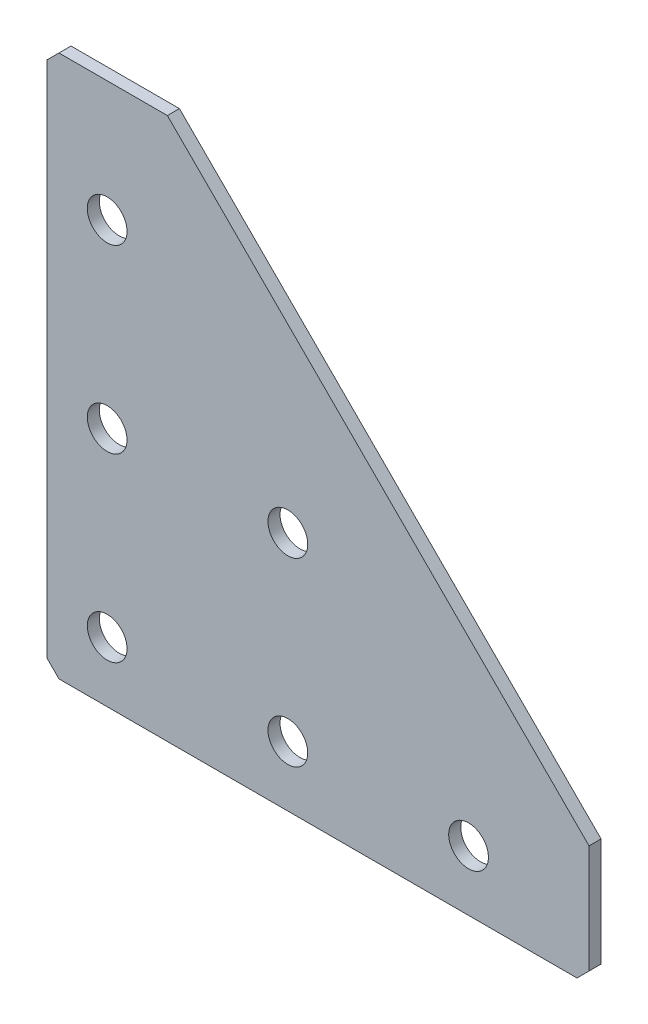
ISO-10303-21;
HEADER;
FILE_DESCRIPTION(('STEP AP214'),'2;1');
FILE_NAME('part.step','',(''),(''),'','','');
FILE_SCHEMA(('AUTOMOTIVE_DESIGN { 1 0 10303 214 1 1 1 1 }'));
ENDSEC;
DATA;
#1=APPLICATION_CONTEXT('core data for automotive mechanical design processes');
#2=APPLICATION_PROTOCOL_DEFINITION('international standard','automotive_design',2000,#1);
#3=PRODUCT_CONTEXT('',#1,'mechanical');
#4=PRODUCT('Part','Part','',(#3));
#5=PRODUCT_RELATED_PRODUCT_CATEGORY('part','',(#4));
#6=PRODUCT_DEFINITION_FORMATION('','',#4);
#7=PRODUCT_DEFINITION_CONTEXT('part definition',#1,'design');
#8=PRODUCT_DEFINITION('design','',#6,#7);
#9=PRODUCT_DEFINITION_SHAPE('','',#8);
#10=(LENGTH_UNIT() NAMED_UNIT(*) SI_UNIT(.MILLI.,.METRE.));
#11=(NAMED_UNIT(*) PLANE_ANGLE_UNIT() SI_UNIT($,.RADIAN.));
#12=(NAMED_UNIT(*) SI_UNIT($,.STERADIAN.) SOLID_ANGLE_UNIT());
#13=UNCERTAINTY_MEASURE_WITH_UNIT(LENGTH_MEASURE(1.E-05),#10,'distance_accuracy_value','');
#14=(GEOMETRIC_REPRESENTATION_CONTEXT(3) GLOBAL_UNCERTAINTY_ASSIGNED_CONTEXT((#13)) GLOBAL_UNIT_ASSIGNED_CONTEXT((#10,
#11,#12)) REPRESENTATION_CONTEXT('',''));
#15=CARTESIAN_POINT('',(0.,0.,0.));
#16=DIRECTION('',(0.,0.,1.));
#17=DIRECTION('',(1.,0.,0.));
#18=AXIS2_PLACEMENT_3D('',#15,#16,#17);
#19=CARTESIAN_POINT('',(20.,0.,-2.));
#20=DIRECTION('',(0.,-1.,0.));
#21=DIRECTION('',(1.,0.,0.));
#22=AXIS2_PLACEMENT_3D('',#19,#20,#21);
#23=PLANE('',#22);
#24=DIRECTION('',(1.,0.,0.));
#25=VECTOR('',#24,1.);
#26=CARTESIAN_POINT('',(20.,0.,-2.));
#27=LINE('',#26,#25);
#28=CARTESIAN_POINT('',(2.00000000000002,0.,-2.));
#29=VERTEX_POINT('',#28);
#30=CARTESIAN_POINT('',(20.,0.,-2.));
#31=VERTEX_POINT('',#30);
#32=EDGE_CURVE('E110',#29,#31,#27,.T.);
#33=ORIENTED_EDGE('',*,*,#32,.F.);
#34=DIRECTION('',(0.,0.,1.));
#35=VECTOR('',#34,1.);
#36=CARTESIAN_POINT('',(2.00000000000002,0.,-2.));
#37=LINE('',#36,#35);
#38=CARTESIAN_POINT('',(2.00000000000002,0.,0.));
#39=VERTEX_POINT('',#38);
#40=EDGE_CURVE('E139',#29,#39,#37,.T.);
#41=ORIENTED_EDGE('',*,*,#40,.T.);
#42=DIRECTION('',(1.,0.,0.));
#43=VECTOR('',#42,1.);
#44=CARTESIAN_POINT('',(20.,0.,0.));
#45=LINE('',#44,#43);
#46=CARTESIAN_POINT('',(20.,0.,0.));
#47=VERTEX_POINT('',#46);
#48=EDGE_CURVE('E136',#39,#47,#45,.T.);
#49=ORIENTED_EDGE('',*,*,#48,.T.);
#50=DIRECTION('',(0.,0.,1.));
#51=VECTOR('',#50,1.);
#52=CARTESIAN_POINT('',(20.,0.,-2.));
#53=LINE('',#52,#51);
#54=EDGE_CURVE('E128',#31,#47,#53,.T.);
#55=ORIENTED_EDGE('',*,*,#54,.F.);
#56=EDGE_LOOP('',(#33,#41,#49,#55));
#57=FACE_BOUND('',#56,.T.);
#58=ADVANCED_FACE('F45',(#57),#23,.F.);
#59=CARTESIAN_POINT('',(20.,0.,-2.));
#60=DIRECTION('',(-0.707106781186548,-0.707106781186547,0.));
#61=DIRECTION('',(0.707106781186547,-0.707106781186548,0.));
#62=AXIS2_PLACEMENT_3D('',#59,#60,#61);
#63=PLANE('',#62);
#64=DIRECTION('',(0.707106781186547,-0.707106781186548,0.));
#65=VECTOR('',#64,1.);
#66=CARTESIAN_POINT('',(20.,0.,0.));
#67=LINE('',#66,#65);
#68=CARTESIAN_POINT('',(90.,-70.,0.));
#69=VERTEX_POINT('',#68);
#70=EDGE_CURVE('E197',#47,#69,#67,.T.);
#71=ORIENTED_EDGE('',*,*,#70,.T.);
#72=DIRECTION('',(0.,0.,1.));
#73=VECTOR('',#72,1.);
#74=CARTESIAN_POINT('',(90.,-70.,-2.));
#75=LINE('',#74,#73);
#76=CARTESIAN_POINT('',(90.,-70.,-2.));
#77=VERTEX_POINT('',#76);
#78=EDGE_CURVE('E130',#77,#69,#75,.T.);
#79=ORIENTED_EDGE('',*,*,#78,.F.);
#80=DIRECTION('',(0.707106781186547,-0.707106781186548,0.));
#81=VECTOR('',#80,1.);
#82=CARTESIAN_POINT('',(20.,0.,-2.));
#83=LINE('',#82,#81);
#84=EDGE_CURVE('E114',#31,#77,#83,.T.);
#85=ORIENTED_EDGE('',*,*,#84,.F.);
#86=ORIENTED_EDGE('',*,*,#54,.T.);
#87=EDGE_LOOP('',(#71,#79,#85,#86));
#88=FACE_BOUND('',#87,.T.);
#89=ADVANCED_FACE('F127',(#88),#63,.F.);
#90=CARTESIAN_POINT('',(90.,-90.,-2.));
#91=DIRECTION('',(-1.,0.,0.));
#92=DIRECTION('',(0.,-1.,0.));
#93=AXIS2_PLACEMENT_3D('',#90,#91,#92);
#94=PLANE('',#93);
#95=DIRECTION('',(0.,-1.,0.));
#96=VECTOR('',#95,1.);
#97=CARTESIAN_POINT('',(90.,-90.,0.));
#98=LINE('',#97,#96);
#99=CARTESIAN_POINT('',(90.,-88.,0.));
#100=VERTEX_POINT('',#99);
#101=EDGE_CURVE('E190',#69,#100,#98,.T.);
#102=ORIENTED_EDGE('',*,*,#101,.T.);
#103=DIRECTION('',(0.,0.,-1.));
#104=VECTOR('',#103,1.);
#105=CARTESIAN_POINT('',(90.,-88.,-2.));
#106=LINE('',#105,#104);
#107=CARTESIAN_POINT('',(90.,-88.,-2.));
#108=VERTEX_POINT('',#107);
#109=EDGE_CURVE('E11',#100,#108,#106,.T.);
#110=ORIENTED_EDGE('',*,*,#109,.T.);
#111=DIRECTION('',(0.,-1.,0.));
#112=VECTOR('',#111,1.);
#113=CARTESIAN_POINT('',(90.,-90.,-2.));
#114=LINE('',#113,#112);
#115=EDGE_CURVE('E133',#77,#108,#114,.T.);
#116=ORIENTED_EDGE('',*,*,#115,.F.);
#117=ORIENTED_EDGE('',*,*,#78,.T.);
#118=EDGE_LOOP('',(#102,#110,#116,#117));
#119=FACE_BOUND('',#118,.T.);
#120=ADVANCED_FACE('F297',(#119),#94,.F.);
#121=CARTESIAN_POINT('',(0.,-90.,-2.));
#122=DIRECTION('',(0.,1.,0.));
#123=DIRECTION('',(0.,0.,1.));
#124=AXIS2_PLACEMENT_3D('',#121,#122,#123);
#125=PLANE('',#124);
#126=DIRECTION('',(-1.,0.,0.));
#127=VECTOR('',#126,1.);
#128=CARTESIAN_POINT('',(0.,-90.,-2.));
#129=LINE('',#128,#127);
#130=CARTESIAN_POINT('',(88.,-90.,-2.));
#131=VERTEX_POINT('',#130);
#132=CARTESIAN_POINT('',(2.,-90.,-2.));
#133=VERTEX_POINT('',#132);
#134=EDGE_CURVE('E182',#131,#133,#129,.T.);
#135=ORIENTED_EDGE('',*,*,#134,.F.);
#136=DIRECTION('',(0.,0.,1.));
#137=VECTOR('',#136,1.);
#138=CARTESIAN_POINT('',(88.,-90.,-2.));
#139=LINE('',#138,#137);
#140=CARTESIAN_POINT('',(88.,-90.,0.));
#141=VERTEX_POINT('',#140);
#142=EDGE_CURVE('E54',#131,#141,#139,.T.);
#143=ORIENTED_EDGE('',*,*,#142,.T.);
#144=DIRECTION('',(-1.,0.,0.));
#145=VECTOR('',#144,1.);
#146=CARTESIAN_POINT('',(0.,-90.,0.));
#147=LINE('',#146,#145);
#148=CARTESIAN_POINT('',(2.,-90.,0.));
#149=VERTEX_POINT('',#148);
#150=EDGE_CURVE('E181',#141,#149,#147,.T.);
#151=ORIENTED_EDGE('',*,*,#150,.T.);
#152=DIRECTION('',(0.,0.,-1.));
#153=VECTOR('',#152,1.);
#154=CARTESIAN_POINT('',(2.,-90.,-2.));
#155=LINE('',#154,#153);
#156=EDGE_CURVE('E61',#149,#133,#155,.T.);
#157=ORIENTED_EDGE('',*,*,#156,.T.);
#158=EDGE_LOOP('',(#135,#143,#151,#157));
#159=FACE_BOUND('',#158,.T.);
#160=ADVANCED_FACE('F180',(#159),#125,.F.);
#161=CARTESIAN_POINT('',(0.,0.,-2.));
#162=DIRECTION('',(1.,0.,0.));
#163=DIRECTION('',(0.,0.,-1.));
#164=AXIS2_PLACEMENT_3D('',#161,#162,#163);
#165=PLANE('',#164);
#166=DIRECTION('',(0.,1.,0.));
#167=VECTOR('',#166,1.);
#168=CARTESIAN_POINT('',(0.,0.,0.));
#169=LINE('',#168,#167);
#170=CARTESIAN_POINT('',(0.,-88.,0.));
#171=VERTEX_POINT('',#170);
#172=CARTESIAN_POINT('',(0.,-2.00000000000002,0.));
#173=VERTEX_POINT('',#172);
#174=EDGE_CURVE('E123',#171,#173,#169,.T.);
#175=ORIENTED_EDGE('',*,*,#174,.T.);
#176=DIRECTION('',(0.,0.,-1.));
#177=VECTOR('',#176,1.);
#178=CARTESIAN_POINT('',(0.,-2.00000000000002,-2.));
#179=LINE('',#178,#177);
#180=CARTESIAN_POINT('',(0.,-2.00000000000002,-2.));
#181=VERTEX_POINT('',#180);
#182=EDGE_CURVE('E163',#173,#181,#179,.T.);
#183=ORIENTED_EDGE('',*,*,#182,.T.);
#184=DIRECTION('',(0.,1.,0.));
#185=VECTOR('',#184,1.);
#186=CARTESIAN_POINT('',(0.,0.,-2.));
#187=LINE('',#186,#185);
#188=CARTESIAN_POINT('',(0.,-88.,-2.));
#189=VERTEX_POINT('',#188);
#190=EDGE_CURVE('E147',#189,#181,#187,.T.);
#191=ORIENTED_EDGE('',*,*,#190,.F.);
#192=DIRECTION('',(0.,0.,1.));
#193=VECTOR('',#192,1.);
#194=CARTESIAN_POINT('',(0.,-88.,-2.));
#195=LINE('',#194,#193);
#196=EDGE_CURVE('E159',#189,#171,#195,.T.);
#197=ORIENTED_EDGE('',*,*,#196,.T.);
#198=EDGE_LOOP('',(#175,#183,#191,#197));
#199=FACE_BOUND('',#198,.T.);
#200=ADVANCED_FACE('F265',(#199),#165,.F.);
#201=CARTESIAN_POINT('',(0.,0.,-2.));
#202=DIRECTION('',(0.,0.,1.));
#203=DIRECTION('',(1.,0.,0.));
#204=AXIS2_PLACEMENT_3D('',#201,#202,#203);
#205=PLANE('',#204);
#206=CARTESIAN_POINT('',(40.,-80.,-2.));
#207=DIRECTION('',(0.,0.,-1.));
#208=DIRECTION('',(0.,1.,0.));
#209=AXIS2_PLACEMENT_3D('',#206,#207,#208);
#210=CIRCLE('',#209,3.3);
#211=CARTESIAN_POINT('',(40.,-76.7,-2.));
#212=VERTEX_POINT('',#211);
#213=EDGE_CURVE('E254',#212,#212,#210,.T.);
#214=ORIENTED_EDGE('',*,*,#213,.F.);
#215=EDGE_LOOP('',(#214));
#216=FACE_BOUND('',#215,.T.);
#217=CARTESIAN_POINT('',(10.,-80.,-2.));
#218=DIRECTION('',(0.,0.,-1.));
#219=DIRECTION('',(0.,1.,0.));
#220=AXIS2_PLACEMENT_3D('',#217,#218,#219);
#221=CIRCLE('',#220,3.3);
#222=CARTESIAN_POINT('',(10.,-76.7,-2.));
#223=VERTEX_POINT('',#222);
#224=EDGE_CURVE('E246',#223,#223,#221,.T.);
#225=ORIENTED_EDGE('',*,*,#224,.F.);
#226=EDGE_LOOP('',(#225));
#227=FACE_BOUND('',#226,.T.);
#228=CARTESIAN_POINT('',(10.,-50.,-2.));
#229=DIRECTION('',(0.,0.,-1.));
#230=DIRECTION('',(0.,1.,0.));
#231=AXIS2_PLACEMENT_3D('',#228,#229,#230);
#232=CIRCLE('',#231,3.3);
#233=CARTESIAN_POINT('',(10.,-46.7,-2.));
#234=VERTEX_POINT('',#233);
#235=EDGE_CURVE('E238',#234,#234,#232,.T.);
#236=ORIENTED_EDGE('',*,*,#235,.F.);
#237=EDGE_LOOP('',(#236));
#238=FACE_BOUND('',#237,.T.);
#239=CARTESIAN_POINT('',(10.,-20.,-2.));
#240=DIRECTION('',(0.,0.,-1.));
#241=DIRECTION('',(0.,1.,0.));
#242=AXIS2_PLACEMENT_3D('',#239,#240,#241);
#243=CIRCLE('',#242,3.3);
#244=CARTESIAN_POINT('',(10.,-16.7,-2.));
#245=VERTEX_POINT('',#244);
#246=EDGE_CURVE('E230',#245,#245,#243,.T.);
#247=ORIENTED_EDGE('',*,*,#246,.F.);
#248=EDGE_LOOP('',(#247));
#249=FACE_BOUND('',#248,.T.);
#250=CARTESIAN_POINT('',(70.,-80.,-2.));
#251=DIRECTION('',(0.,0.,-1.));
#252=DIRECTION('',(0.,1.,0.));
#253=AXIS2_PLACEMENT_3D('',#250,#251,#252);
#254=CIRCLE('',#253,3.3);
#255=CARTESIAN_POINT('',(70.,-76.7,-2.));
#256=VERTEX_POINT('',#255);
#257=EDGE_CURVE('E222',#256,#256,#254,.T.);
#258=ORIENTED_EDGE('',*,*,#257,.F.);
#259=EDGE_LOOP('',(#258));
#260=FACE_BOUND('',#259,.T.);
#261=CARTESIAN_POINT('',(40.,-50.,-2.));
#262=DIRECTION('',(0.,0.,-1.));
#263=DIRECTION('',(0.,1.,0.));
#264=AXIS2_PLACEMENT_3D('',#261,#262,#263);
#265=CIRCLE('',#264,3.3);
#266=CARTESIAN_POINT('',(40.,-46.7,-2.));
#267=VERTEX_POINT('',#266);
#268=EDGE_CURVE('E214',#267,#267,#265,.T.);
#269=ORIENTED_EDGE('',*,*,#268,.F.);
#270=EDGE_LOOP('',(#269));
#271=FACE_BOUND('',#270,.T.);
#272=ORIENTED_EDGE('',*,*,#190,.T.);
#273=DIRECTION('',(-0.707106781186547,-0.707106781186548,0.));
#274=VECTOR('',#273,1.);
#275=CARTESIAN_POINT('',(2.00000000000002,0.,-2.));
#276=LINE('',#275,#274);
#277=EDGE_CURVE('E117',#181,#29,#276,.F.);
#278=ORIENTED_EDGE('',*,*,#277,.T.);
#279=ORIENTED_EDGE('',*,*,#32,.T.);
#280=ORIENTED_EDGE('',*,*,#84,.T.);
#281=ORIENTED_EDGE('',*,*,#115,.T.);
#282=DIRECTION('',(0.707106781186548,0.707106781186548,0.));
#283=VECTOR('',#282,1.);
#284=CARTESIAN_POINT('',(88.,-90.,-2.));
#285=LINE('',#284,#283);
#286=EDGE_CURVE('E68',#108,#131,#285,.F.);
#287=ORIENTED_EDGE('',*,*,#286,.T.);
#288=ORIENTED_EDGE('',*,*,#134,.T.);
#289=DIRECTION('',(0.70710678118655,-0.707106781186545,0.));
#290=VECTOR('',#289,1.);
#291=CARTESIAN_POINT('',(0.,-88.,-2.));
#292=LINE('',#291,#290);
#293=EDGE_CURVE('E166',#133,#189,#292,.F.);
#294=ORIENTED_EDGE('',*,*,#293,.T.);
#295=EDGE_LOOP('',(#272,#278,#279,#280,#281,#287,#288,#294));
#296=FACE_BOUND('',#295,.T.);
#297=ADVANCED_FACE('F113',(#216,#227,#238,#249,#260,#271,#296),#205,.F.);
#298=CARTESIAN_POINT('',(0.,0.,0.));
#299=DIRECTION('',(0.,0.,1.));
#300=DIRECTION('',(1.,0.,0.));
#301=AXIS2_PLACEMENT_3D('',#298,#299,#300);
#302=PLANE('',#301);
#303=CARTESIAN_POINT('',(40.,-80.,0.));
#304=DIRECTION('',(0.,0.,-1.));
#305=DIRECTION('',(0.,1.,0.));
#306=AXIS2_PLACEMENT_3D('',#303,#304,#305);
#307=CIRCLE('',#306,3.3);
#308=CARTESIAN_POINT('',(40.,-76.7,0.));
#309=VERTEX_POINT('',#308);
#310=EDGE_CURVE('E250',#309,#309,#307,.T.);
#311=ORIENTED_EDGE('',*,*,#310,.T.);
#312=EDGE_LOOP('',(#311));
#313=FACE_BOUND('',#312,.T.);
#314=CARTESIAN_POINT('',(10.,-80.,0.));
#315=DIRECTION('',(0.,0.,-1.));
#316=DIRECTION('',(0.,1.,0.));
#317=AXIS2_PLACEMENT_3D('',#314,#315,#316);
#318=CIRCLE('',#317,3.3);
#319=CARTESIAN_POINT('',(10.,-76.7,0.));
#320=VERTEX_POINT('',#319);
#321=EDGE_CURVE('E242',#320,#320,#318,.T.);
#322=ORIENTED_EDGE('',*,*,#321,.T.);
#323=EDGE_LOOP('',(#322));
#324=FACE_BOUND('',#323,.T.);
#325=CARTESIAN_POINT('',(10.,-50.,0.));
#326=DIRECTION('',(0.,0.,-1.));
#327=DIRECTION('',(0.,1.,0.));
#328=AXIS2_PLACEMENT_3D('',#325,#326,#327);
#329=CIRCLE('',#328,3.3);
#330=CARTESIAN_POINT('',(10.,-46.7,0.));
#331=VERTEX_POINT('',#330);
#332=EDGE_CURVE('E234',#331,#331,#329,.T.);
#333=ORIENTED_EDGE('',*,*,#332,.T.);
#334=EDGE_LOOP('',(#333));
#335=FACE_BOUND('',#334,.T.);
#336=CARTESIAN_POINT('',(10.,-20.,0.));
#337=DIRECTION('',(0.,0.,-1.));
#338=DIRECTION('',(0.,1.,0.));
#339=AXIS2_PLACEMENT_3D('',#336,#337,#338);
#340=CIRCLE('',#339,3.3);
#341=CARTESIAN_POINT('',(10.,-16.7,0.));
#342=VERTEX_POINT('',#341);
#343=EDGE_CURVE('E226',#342,#342,#340,.T.);
#344=ORIENTED_EDGE('',*,*,#343,.T.);
#345=EDGE_LOOP('',(#344));
#346=FACE_BOUND('',#345,.T.);
#347=CARTESIAN_POINT('',(70.,-80.,0.));
#348=DIRECTION('',(0.,0.,-1.));
#349=DIRECTION('',(0.,1.,0.));
#350=AXIS2_PLACEMENT_3D('',#347,#348,#349);
#351=CIRCLE('',#350,3.3);
#352=CARTESIAN_POINT('',(70.,-76.7,0.));
#353=VERTEX_POINT('',#352);
#354=EDGE_CURVE('E218',#353,#353,#351,.T.);
#355=ORIENTED_EDGE('',*,*,#354,.T.);
#356=EDGE_LOOP('',(#355));
#357=FACE_BOUND('',#356,.T.);
#358=CARTESIAN_POINT('',(40.,-50.,0.));
#359=DIRECTION('',(0.,0.,-1.));
#360=DIRECTION('',(0.,1.,0.));
#361=AXIS2_PLACEMENT_3D('',#358,#359,#360);
#362=CIRCLE('',#361,3.3);
#363=CARTESIAN_POINT('',(40.,-46.7,0.));
#364=VERTEX_POINT('',#363);
#365=EDGE_CURVE('E204',#364,#364,#362,.T.);
#366=ORIENTED_EDGE('',*,*,#365,.T.);
#367=EDGE_LOOP('',(#366));
#368=FACE_BOUND('',#367,.T.);
#369=ORIENTED_EDGE('',*,*,#48,.F.);
#370=DIRECTION('',(0.707106781186547,0.707106781186548,0.));
#371=VECTOR('',#370,1.);
#372=CARTESIAN_POINT('',(1.00000000000001,-1.00000000000001,0.));
#373=LINE('',#372,#371);
#374=EDGE_CURVE('E156',#39,#173,#373,.F.);
#375=ORIENTED_EDGE('',*,*,#374,.T.);
#376=ORIENTED_EDGE('',*,*,#174,.F.);
#377=DIRECTION('',(-0.70710678118655,0.707106781186545,0.));
#378=VECTOR('',#377,1.);
#379=CARTESIAN_POINT('',(-44.,-44.0000000000003,0.));
#380=LINE('',#379,#378);
#381=EDGE_CURVE('E145',#171,#149,#380,.F.);
#382=ORIENTED_EDGE('',*,*,#381,.T.);
#383=ORIENTED_EDGE('',*,*,#150,.F.);
#384=DIRECTION('',(-0.707106781186548,-0.707106781186548,0.));
#385=VECTOR('',#384,1.);
#386=CARTESIAN_POINT('',(89.,-89.,0.));
#387=LINE('',#386,#385);
#388=EDGE_CURVE('E153',#141,#100,#387,.F.);
#389=ORIENTED_EDGE('',*,*,#388,.T.);
#390=ORIENTED_EDGE('',*,*,#101,.F.);
#391=ORIENTED_EDGE('',*,*,#70,.F.);
#392=EDGE_LOOP('',(#369,#375,#376,#382,#383,#389,#390,#391));
#393=FACE_BOUND('',#392,.T.);
#394=ADVANCED_FACE('F185',(#313,#324,#335,#346,#357,#368,#393),#302,.T.);
#395=CARTESIAN_POINT('',(40.,-50.,-2.));
#396=DIRECTION('',(0.,0.,-1.));
#397=DIRECTION('',(0.,1.,0.));
#398=AXIS2_PLACEMENT_3D('',#395,#396,#397);
#399=CYLINDRICAL_SURFACE('',#398,3.3);
#400=ORIENTED_EDGE('',*,*,#365,.F.);
#401=EDGE_LOOP('',(#400));
#402=FACE_BOUND('',#401,.T.);
#403=ORIENTED_EDGE('',*,*,#268,.T.);
#404=EDGE_LOOP('',(#403));
#405=FACE_BOUND('',#404,.T.);
#406=ADVANCED_FACE('F277',(#402,#405),#399,.F.);
#407=CARTESIAN_POINT('',(70.,-80.,-2.));
#408=DIRECTION('',(0.,0.,-1.));
#409=DIRECTION('',(0.,1.,0.));
#410=AXIS2_PLACEMENT_3D('',#407,#408,#409);
#411=CYLINDRICAL_SURFACE('',#410,3.3);
#412=ORIENTED_EDGE('',*,*,#354,.F.);
#413=EDGE_LOOP('',(#412));
#414=FACE_BOUND('',#413,.T.);
#415=ORIENTED_EDGE('',*,*,#257,.T.);
#416=EDGE_LOOP('',(#415));
#417=FACE_BOUND('',#416,.T.);
#418=ADVANCED_FACE('F279',(#414,#417),#411,.F.);
#419=CARTESIAN_POINT('',(10.,-20.,-2.));
#420=DIRECTION('',(0.,0.,-1.));
#421=DIRECTION('',(0.,1.,0.));
#422=AXIS2_PLACEMENT_3D('',#419,#420,#421);
#423=CYLINDRICAL_SURFACE('',#422,3.3);
#424=ORIENTED_EDGE('',*,*,#343,.F.);
#425=EDGE_LOOP('',(#424));
#426=FACE_BOUND('',#425,.T.);
#427=ORIENTED_EDGE('',*,*,#246,.T.);
#428=EDGE_LOOP('',(#427));
#429=FACE_BOUND('',#428,.T.);
#430=ADVANCED_FACE('F286',(#426,#429),#423,.F.);
#431=CARTESIAN_POINT('',(10.,-50.,-2.));
#432=DIRECTION('',(0.,0.,-1.));
#433=DIRECTION('',(0.,1.,0.));
#434=AXIS2_PLACEMENT_3D('',#431,#432,#433);
#435=CYLINDRICAL_SURFACE('',#434,3.3);
#436=ORIENTED_EDGE('',*,*,#332,.F.);
#437=EDGE_LOOP('',(#436));
#438=FACE_BOUND('',#437,.T.);
#439=ORIENTED_EDGE('',*,*,#235,.T.);
#440=EDGE_LOOP('',(#439));
#441=FACE_BOUND('',#440,.T.);
#442=ADVANCED_FACE('F361',(#438,#441),#435,.F.);
#443=CARTESIAN_POINT('',(10.,-80.,-2.));
#444=DIRECTION('',(0.,0.,-1.));
#445=DIRECTION('',(0.,1.,0.));
#446=AXIS2_PLACEMENT_3D('',#443,#444,#445);
#447=CYLINDRICAL_SURFACE('',#446,3.3);
#448=ORIENTED_EDGE('',*,*,#321,.F.);
#449=EDGE_LOOP('',(#448));
#450=FACE_BOUND('',#449,.T.);
#451=ORIENTED_EDGE('',*,*,#224,.T.);
#452=EDGE_LOOP('',(#451));
#453=FACE_BOUND('',#452,.T.);
#454=ADVANCED_FACE('F370',(#450,#453),#447,.F.);
#455=CARTESIAN_POINT('',(40.,-80.,-2.));
#456=DIRECTION('',(0.,0.,-1.));
#457=DIRECTION('',(0.,1.,0.));
#458=AXIS2_PLACEMENT_3D('',#455,#456,#457);
#459=CYLINDRICAL_SURFACE('',#458,3.3);
#460=ORIENTED_EDGE('',*,*,#310,.F.);
#461=EDGE_LOOP('',(#460));
#462=FACE_BOUND('',#461,.T.);
#463=ORIENTED_EDGE('',*,*,#213,.T.);
#464=EDGE_LOOP('',(#463));
#465=FACE_BOUND('',#464,.T.);
#466=ADVANCED_FACE('F261',(#462,#465),#459,.F.);
#467=CARTESIAN_POINT('',(2.00000000000002,0.,-2.));
#468=DIRECTION('',(0.707106781186548,-0.707106781186547,0.));
#469=DIRECTION('',(0.,0.,1.));
#470=AXIS2_PLACEMENT_3D('',#467,#468,#469);
#471=PLANE('',#470);
#472=ORIENTED_EDGE('',*,*,#277,.F.);
#473=ORIENTED_EDGE('',*,*,#182,.F.);
#474=ORIENTED_EDGE('',*,*,#374,.F.);
#475=ORIENTED_EDGE('',*,*,#40,.F.);
#476=EDGE_LOOP('',(#472,#473,#474,#475));
#477=FACE_BOUND('',#476,.T.);
#478=ADVANCED_FACE('F301',(#477),#471,.F.);
#479=CARTESIAN_POINT('',(88.,-90.,-2.));
#480=DIRECTION('',(-0.707106781186547,0.707106781186547,0.));
#481=DIRECTION('',(0.,0.,1.));
#482=AXIS2_PLACEMENT_3D('',#479,#480,#481);
#483=PLANE('',#482);
#484=ORIENTED_EDGE('',*,*,#286,.F.);
#485=ORIENTED_EDGE('',*,*,#109,.F.);
#486=ORIENTED_EDGE('',*,*,#388,.F.);
#487=ORIENTED_EDGE('',*,*,#142,.F.);
#488=EDGE_LOOP('',(#484,#485,#486,#487));
#489=FACE_BOUND('',#488,.T.);
#490=ADVANCED_FACE('F303',(#489),#483,.F.);
#491=CARTESIAN_POINT('',(0.,-88.,-2.));
#492=DIRECTION('',(0.707106781186545,0.70710678118655,0.));
#493=DIRECTION('',(0.,0.,1.));
#494=AXIS2_PLACEMENT_3D('',#491,#492,#493);
#495=PLANE('',#494);
#496=ORIENTED_EDGE('',*,*,#293,.F.);
#497=ORIENTED_EDGE('',*,*,#156,.F.);
#498=ORIENTED_EDGE('',*,*,#381,.F.);
#499=ORIENTED_EDGE('',*,*,#196,.F.);
#500=EDGE_LOOP('',(#496,#497,#498,#499));
#501=FACE_BOUND('',#500,.T.);
#502=ADVANCED_FACE('F47',(#501),#495,.F.);
#503=CLOSED_SHELL('',(#58,#89,#120,#160,#200,#297,#394,#406,#418,#430,#442,#454,#466,#478,#490,#502));
#504=MANIFOLD_SOLID_BREP('B2',#503);
#505=ADVANCED_BREP_SHAPE_REPRESENTATION('',(#18,#504),#14);
#506=SHAPE_DEFINITION_REPRESENTATION(#9,#505);
ENDSEC;
END-ISO-10303-21;
